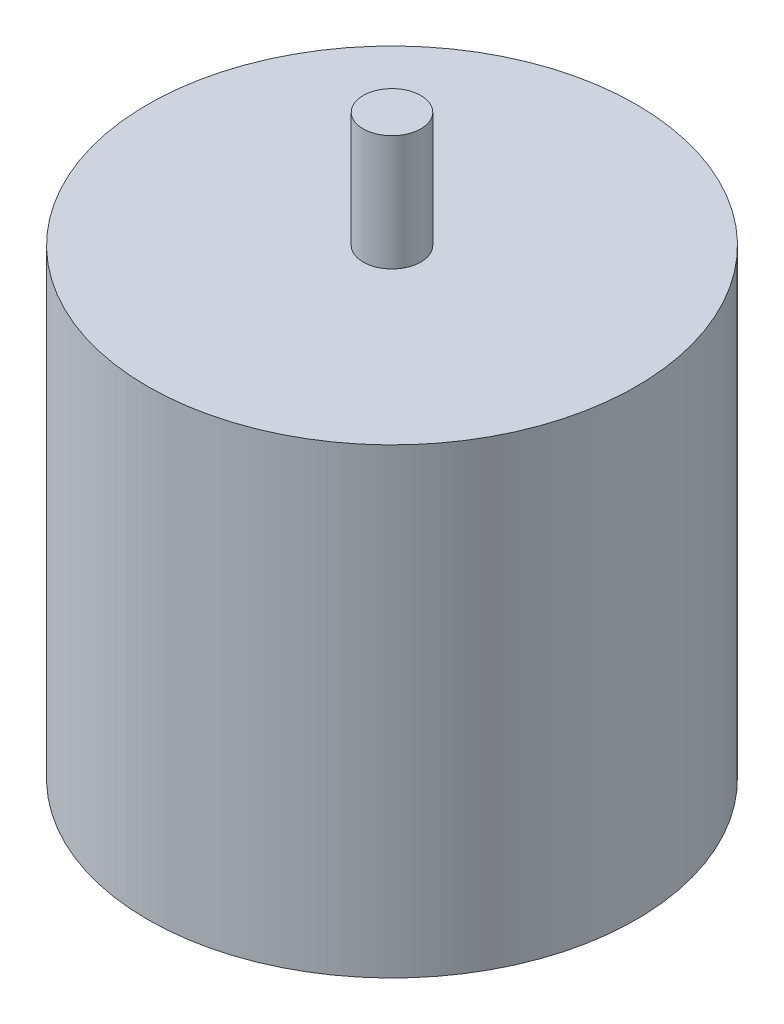
ISO-10303-21;
HEADER;
FILE_DESCRIPTION(('STEP AP214'),'2;1');
FILE_NAME('part.step','',(''),(''),'','','');
FILE_SCHEMA(('AUTOMOTIVE_DESIGN { 1 0 10303 214 1 1 1 1 }'));
ENDSEC;
DATA;
#1=APPLICATION_CONTEXT('core data for automotive mechanical design processes');
#2=APPLICATION_PROTOCOL_DEFINITION('international standard','automotive_design',2000,#1);
#3=PRODUCT_CONTEXT('',#1,'mechanical');
#4=PRODUCT('Part','Part','',(#3));
#5=PRODUCT_RELATED_PRODUCT_CATEGORY('part','',(#4));
#6=PRODUCT_DEFINITION_FORMATION('','',#4);
#7=PRODUCT_DEFINITION_CONTEXT('part definition',#1,'design');
#8=PRODUCT_DEFINITION('design','',#6,#7);
#9=PRODUCT_DEFINITION_SHAPE('','',#8);
#10=(LENGTH_UNIT() NAMED_UNIT(*) SI_UNIT(.MILLI.,.METRE.));
#11=(NAMED_UNIT(*) PLANE_ANGLE_UNIT() SI_UNIT($,.RADIAN.));
#12=(NAMED_UNIT(*) SI_UNIT($,.STERADIAN.) SOLID_ANGLE_UNIT());
#13=UNCERTAINTY_MEASURE_WITH_UNIT(LENGTH_MEASURE(1.E-05),#10,'distance_accuracy_value','');
#14=(GEOMETRIC_REPRESENTATION_CONTEXT(3) GLOBAL_UNCERTAINTY_ASSIGNED_CONTEXT((#13)) GLOBAL_UNIT_ASSIGNED_CONTEXT((#10,
#11,#12)) REPRESENTATION_CONTEXT('',''));
#15=CARTESIAN_POINT('',(0.,0.,0.));
#16=DIRECTION('',(0.,0.,1.));
#17=DIRECTION('',(1.,0.,0.));
#18=AXIS2_PLACEMENT_3D('',#15,#16,#17);
#19=CARTESIAN_POINT('',(0.,40.,0.));
#20=DIRECTION('',(0.,-1.,0.));
#21=DIRECTION('',(0.,0.,-1.));
#22=AXIS2_PLACEMENT_3D('',#19,#20,#21);
#23=CYLINDRICAL_SURFACE('',#22,2.5);
#24=CARTESIAN_POINT('',(0.,0.,0.));
#25=DIRECTION('',(0.,1.,0.));
#26=DIRECTION('',(0.,0.,1.));
#27=AXIS2_PLACEMENT_3D('',#24,#25,#26);
#28=CIRCLE('',#27,2.5);
#29=CARTESIAN_POINT('',(0.,0.,2.5));
#30=VERTEX_POINT('',#29);
#31=EDGE_CURVE('E43',#30,#30,#28,.T.);
#32=ORIENTED_EDGE('',*,*,#31,.F.);
#33=EDGE_LOOP('',(#32));
#34=FACE_BOUND('',#33,.T.);
#35=CARTESIAN_POINT('',(0.,10.,0.));
#36=DIRECTION('',(0.,1.,0.));
#37=DIRECTION('',(0.,0.,1.));
#38=AXIS2_PLACEMENT_3D('',#35,#36,#37);
#39=CIRCLE('',#38,2.5);
#40=CARTESIAN_POINT('',(0.,10.,2.5));
#41=VERTEX_POINT('',#40);
#42=EDGE_CURVE('E46',#41,#41,#39,.T.);
#43=ORIENTED_EDGE('',*,*,#42,.T.);
#44=EDGE_LOOP('',(#43));
#45=FACE_BOUND('',#44,.T.);
#46=ADVANCED_FACE('F30',(#34,#45),#23,.F.);
#47=CARTESIAN_POINT('',(0.,40.,0.));
#48=DIRECTION('',(0.,1.,0.));
#49=DIRECTION('',(0.,0.,1.));
#50=AXIS2_PLACEMENT_3D('',#47,#48,#49);
#51=PLANE('',#50);
#52=CARTESIAN_POINT('',(0.,40.,0.));
#53=DIRECTION('',(0.,1.,0.));
#54=DIRECTION('',(0.,0.,1.));
#55=AXIS2_PLACEMENT_3D('',#52,#53,#54);
#56=CIRCLE('',#55,21.1666666666667);
#57=CARTESIAN_POINT('',(0.,40.,21.1666666666667));
#58=VERTEX_POINT('',#57);
#59=EDGE_CURVE('E10',#58,#58,#56,.T.);
#60=ORIENTED_EDGE('',*,*,#59,.T.);
#61=EDGE_LOOP('',(#60));
#62=FACE_BOUND('',#61,.T.);
#63=CARTESIAN_POINT('',(0.,40.,0.));
#64=DIRECTION('',(0.,1.,0.));
#65=DIRECTION('',(0.,0.,1.));
#66=AXIS2_PLACEMENT_3D('',#63,#64,#65);
#67=CIRCLE('',#66,2.5);
#68=CARTESIAN_POINT('',(0.,40.,2.5));
#69=VERTEX_POINT('',#68);
#70=EDGE_CURVE('E41',#69,#69,#67,.T.);
#71=ORIENTED_EDGE('',*,*,#70,.F.);
#72=EDGE_LOOP('',(#71));
#73=FACE_BOUND('',#72,.T.);
#74=ADVANCED_FACE('F71',(#62,#73),#51,.T.);
#75=CARTESIAN_POINT('',(0.,0.,0.));
#76=DIRECTION('',(0.,1.,0.));
#77=DIRECTION('',(0.,0.,1.));
#78=AXIS2_PLACEMENT_3D('',#75,#76,#77);
#79=PLANE('',#78);
#80=CARTESIAN_POINT('',(0.,0.,0.));
#81=DIRECTION('',(0.,1.,0.));
#82=DIRECTION('',(0.,0.,1.));
#83=AXIS2_PLACEMENT_3D('',#80,#81,#82);
#84=CIRCLE('',#83,21.1666666666667);
#85=CARTESIAN_POINT('',(0.,0.,21.1666666666667));
#86=VERTEX_POINT('',#85);
#87=EDGE_CURVE('E34',#86,#86,#84,.T.);
#88=ORIENTED_EDGE('',*,*,#87,.F.);
#89=EDGE_LOOP('',(#88));
#90=FACE_BOUND('',#89,.T.);
#91=ORIENTED_EDGE('',*,*,#31,.T.);
#92=EDGE_LOOP('',(#91));
#93=FACE_BOUND('',#92,.T.);
#94=ADVANCED_FACE('F76',(#90,#93),#79,.F.);
#95=CARTESIAN_POINT('',(0.,40.,0.));
#96=DIRECTION('',(0.,-1.,0.));
#97=DIRECTION('',(0.,0.,-1.));
#98=AXIS2_PLACEMENT_3D('',#95,#96,#97);
#99=CYLINDRICAL_SURFACE('',#98,21.1666666666667);
#100=ORIENTED_EDGE('',*,*,#59,.F.);
#101=EDGE_LOOP('',(#100));
#102=FACE_BOUND('',#101,.T.);
#103=ORIENTED_EDGE('',*,*,#87,.T.);
#104=EDGE_LOOP('',(#103));
#105=FACE_BOUND('',#104,.T.);
#106=ADVANCED_FACE('F32',(#102,#105),#99,.T.);
#107=CARTESIAN_POINT('',(0.,10.,0.));
#108=DIRECTION('',(0.,1.,0.));
#109=DIRECTION('',(0.,0.,1.));
#110=AXIS2_PLACEMENT_3D('',#107,#108,#109);
#111=PLANE('',#110);
#112=ORIENTED_EDGE('',*,*,#42,.F.);
#113=EDGE_LOOP('',(#112));
#114=FACE_BOUND('',#113,.T.);
#115=ADVANCED_FACE('F59',(#114),#111,.F.);
#116=CARTESIAN_POINT('',(0.,10.,0.));
#117=DIRECTION('',(0.,1.,0.));
#118=DIRECTION('',(0.,0.,1.));
#119=AXIS2_PLACEMENT_3D('',#116,#117,#118);
#120=CYLINDRICAL_SURFACE('',#119,2.5);
#121=ORIENTED_EDGE('',*,*,#70,.T.);
#122=EDGE_LOOP('',(#121));
#123=FACE_BOUND('',#122,.T.);
#124=CARTESIAN_POINT('',(0.,50.,0.));
#125=DIRECTION('',(0.,1.,0.));
#126=DIRECTION('',(0.,0.,1.));
#127=AXIS2_PLACEMENT_3D('',#124,#125,#126);
#128=CIRCLE('',#127,2.5);
#129=CARTESIAN_POINT('',(0.,50.,2.5));
#130=VERTEX_POINT('',#129);
#131=EDGE_CURVE('E51',#130,#130,#128,.T.);
#132=ORIENTED_EDGE('',*,*,#131,.F.);
#133=EDGE_LOOP('',(#132));
#134=FACE_BOUND('',#133,.T.);
#135=ADVANCED_FACE('F57',(#123,#134),#120,.T.);
#136=CARTESIAN_POINT('',(0.,50.,0.));
#137=DIRECTION('',(0.,1.,0.));
#138=DIRECTION('',(0.,0.,1.));
#139=AXIS2_PLACEMENT_3D('',#136,#137,#138);
#140=PLANE('',#139);
#141=ORIENTED_EDGE('',*,*,#131,.T.);
#142=EDGE_LOOP('',(#141));
#143=FACE_BOUND('',#142,.T.);
#144=ADVANCED_FACE('F55',(#143),#140,.T.);
#145=CLOSED_SHELL('',(#46,#74,#94,#106,#115,#135,#144));
#146=MANIFOLD_SOLID_BREP('B2',#145);
#147=ADVANCED_BREP_SHAPE_REPRESENTATION('',(#18,#146),#14);
#148=SHAPE_DEFINITION_REPRESENTATION(#9,#147);
ENDSEC;
END-ISO-10303-21;
